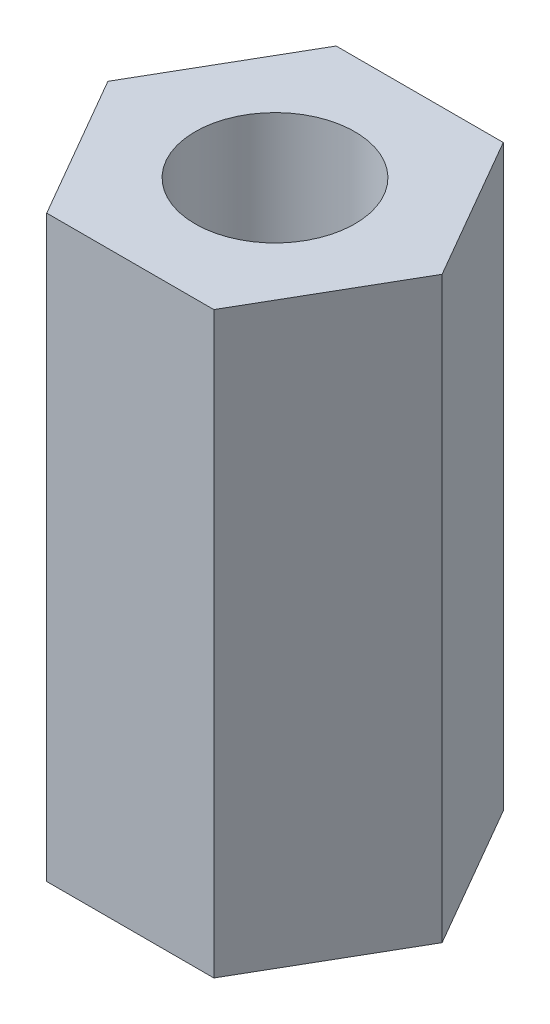
ISO-10303-21;
HEADER;
FILE_DESCRIPTION(('STEP AP214'),'2;1');
FILE_NAME('part.step','',(''),(''),'','','');
FILE_SCHEMA(('AUTOMOTIVE_DESIGN { 1 0 10303 214 1 1 1 1 }'));
ENDSEC;
DATA;
#1=APPLICATION_CONTEXT('core data for automotive mechanical design processes');
#2=APPLICATION_PROTOCOL_DEFINITION('international standard','automotive_design',2000,#1);
#3=PRODUCT_CONTEXT('',#1,'mechanical');
#4=PRODUCT('Part','Part','',(#3));
#5=PRODUCT_RELATED_PRODUCT_CATEGORY('part','',(#4));
#6=PRODUCT_DEFINITION_FORMATION('','',#4);
#7=PRODUCT_DEFINITION_CONTEXT('part definition',#1,'design');
#8=PRODUCT_DEFINITION('design','',#6,#7);
#9=PRODUCT_DEFINITION_SHAPE('','',#8);
#10=(LENGTH_UNIT() NAMED_UNIT(*) SI_UNIT(.MILLI.,.METRE.));
#11=(NAMED_UNIT(*) PLANE_ANGLE_UNIT() SI_UNIT($,.RADIAN.));
#12=(NAMED_UNIT(*) SI_UNIT($,.STERADIAN.) SOLID_ANGLE_UNIT());
#13=UNCERTAINTY_MEASURE_WITH_UNIT(LENGTH_MEASURE(1.E-05),#10,'distance_accuracy_value','');
#14=(GEOMETRIC_REPRESENTATION_CONTEXT(3) GLOBAL_UNCERTAINTY_ASSIGNED_CONTEXT((#13)) GLOBAL_UNIT_ASSIGNED_CONTEXT((#10,
#11,#12)) REPRESENTATION_CONTEXT('',''));
#15=CARTESIAN_POINT('',(0.,0.,0.));
#16=DIRECTION('',(0.,0.,1.));
#17=DIRECTION('',(1.,0.,0.));
#18=AXIS2_PLACEMENT_3D('',#15,#16,#17);
#19=CARTESIAN_POINT('',(3.66617420935412,12.7,0.));
#20=DIRECTION('',(0.,1.,0.));
#21=DIRECTION('',(0.,0.,1.));
#22=AXIS2_PLACEMENT_3D('',#19,#20,#21);
#23=PLANE('',#22);
#24=DIRECTION('',(0.5,0.,-0.866025403784439));
#25=VECTOR('',#24,1.);
#26=CARTESIAN_POINT('',(1.83308710467706,12.7,3.175));
#27=LINE('',#26,#25);
#28=CARTESIAN_POINT('',(1.83308710467706,12.7,3.175));
#29=VERTEX_POINT('',#28);
#30=CARTESIAN_POINT('',(3.66617420935412,12.7,0.));
#31=VERTEX_POINT('',#30);
#32=EDGE_CURVE('E129',#29,#31,#27,.T.);
#33=ORIENTED_EDGE('',*,*,#32,.T.);
#34=DIRECTION('',(-0.5,0.,-0.866025403784438));
#35=VECTOR('',#34,1.);
#36=CARTESIAN_POINT('',(3.66617420935412,12.7,0.));
#37=LINE('',#36,#35);
#38=CARTESIAN_POINT('',(1.83308710467706,12.7,-3.175));
#39=VERTEX_POINT('',#38);
#40=EDGE_CURVE('E87',#31,#39,#37,.T.);
#41=ORIENTED_EDGE('',*,*,#40,.T.);
#42=DIRECTION('',(-1.,0.,0.));
#43=VECTOR('',#42,1.);
#44=CARTESIAN_POINT('',(1.83308710467706,12.7,-3.175));
#45=LINE('',#44,#43);
#46=CARTESIAN_POINT('',(-1.83308710467706,12.7,-3.175));
#47=VERTEX_POINT('',#46);
#48=EDGE_CURVE('E100',#39,#47,#45,.T.);
#49=ORIENTED_EDGE('',*,*,#48,.T.);
#50=DIRECTION('',(-0.5,0.,0.866025403784439));
#51=VECTOR('',#50,1.);
#52=CARTESIAN_POINT('',(-1.83308710467706,12.7,-3.175));
#53=LINE('',#52,#51);
#54=CARTESIAN_POINT('',(-3.66617420935412,12.7,0.));
#55=VERTEX_POINT('',#54);
#56=EDGE_CURVE('E94',#47,#55,#53,.T.);
#57=ORIENTED_EDGE('',*,*,#56,.T.);
#58=DIRECTION('',(0.5,0.,0.866025403784438));
#59=VECTOR('',#58,1.);
#60=CARTESIAN_POINT('',(-3.66617420935412,12.7,0.));
#61=LINE('',#60,#59);
#62=CARTESIAN_POINT('',(-1.83308710467706,12.7,3.175));
#63=VERTEX_POINT('',#62);
#64=EDGE_CURVE('E98',#55,#63,#61,.T.);
#65=ORIENTED_EDGE('',*,*,#64,.T.);
#66=DIRECTION('',(1.,0.,0.));
#67=VECTOR('',#66,1.);
#68=CARTESIAN_POINT('',(-1.83308710467706,12.7,3.175));
#69=LINE('',#68,#67);
#70=EDGE_CURVE('E50',#63,#29,#69,.T.);
#71=ORIENTED_EDGE('',*,*,#70,.T.);
#72=EDGE_LOOP('',(#33,#41,#49,#57,#65,#71));
#73=FACE_BOUND('',#72,.T.);
#74=CARTESIAN_POINT('',(0.,12.7,0.));
#75=DIRECTION('',(0.,1.,0.));
#76=DIRECTION('',(0.,0.,1.));
#77=AXIS2_PLACEMENT_3D('',#74,#75,#76);
#78=CIRCLE('',#77,1.7526);
#79=CARTESIAN_POINT('',(0.,12.7,1.7526));
#80=VERTEX_POINT('',#79);
#81=EDGE_CURVE('E122',#80,#80,#78,.T.);
#82=ORIENTED_EDGE('',*,*,#81,.F.);
#83=EDGE_LOOP('',(#82));
#84=FACE_BOUND('',#83,.T.);
#85=ADVANCED_FACE('F33',(#73,#84),#23,.T.);
#86=CARTESIAN_POINT('',(3.66617420935412,0.,0.));
#87=DIRECTION('',(0.,1.,0.));
#88=DIRECTION('',(0.,0.,1.));
#89=AXIS2_PLACEMENT_3D('',#86,#87,#88);
#90=PLANE('',#89);
#91=DIRECTION('',(0.5,0.,-0.866025403784439));
#92=VECTOR('',#91,1.);
#93=CARTESIAN_POINT('',(1.83308710467706,0.,3.175));
#94=LINE('',#93,#92);
#95=CARTESIAN_POINT('',(1.83308710467706,0.,3.175));
#96=VERTEX_POINT('',#95);
#97=CARTESIAN_POINT('',(3.66617420935412,0.,0.));
#98=VERTEX_POINT('',#97);
#99=EDGE_CURVE('E118',#96,#98,#94,.T.);
#100=ORIENTED_EDGE('',*,*,#99,.F.);
#101=DIRECTION('',(1.,0.,0.));
#102=VECTOR('',#101,1.);
#103=CARTESIAN_POINT('',(-1.83308710467706,0.,3.175));
#104=LINE('',#103,#102);
#105=CARTESIAN_POINT('',(-1.83308710467706,0.,3.175));
#106=VERTEX_POINT('',#105);
#107=EDGE_CURVE('E79',#106,#96,#104,.T.);
#108=ORIENTED_EDGE('',*,*,#107,.F.);
#109=DIRECTION('',(0.5,0.,0.866025403784438));
#110=VECTOR('',#109,1.);
#111=CARTESIAN_POINT('',(-3.66617420935412,0.,0.));
#112=LINE('',#111,#110);
#113=CARTESIAN_POINT('',(-3.66617420935412,0.,0.));
#114=VERTEX_POINT('',#113);
#115=EDGE_CURVE('E73',#114,#106,#112,.T.);
#116=ORIENTED_EDGE('',*,*,#115,.F.);
#117=DIRECTION('',(-0.5,0.,0.866025403784439));
#118=VECTOR('',#117,1.);
#119=CARTESIAN_POINT('',(-1.83308710467706,0.,-3.175));
#120=LINE('',#119,#118);
#121=CARTESIAN_POINT('',(-1.83308710467706,0.,-3.175));
#122=VERTEX_POINT('',#121);
#123=EDGE_CURVE('E108',#122,#114,#120,.T.);
#124=ORIENTED_EDGE('',*,*,#123,.F.);
#125=DIRECTION('',(-1.,0.,0.));
#126=VECTOR('',#125,1.);
#127=CARTESIAN_POINT('',(1.83308710467706,0.,-3.175));
#128=LINE('',#127,#126);
#129=CARTESIAN_POINT('',(1.83308710467706,0.,-3.175));
#130=VERTEX_POINT('',#129);
#131=EDGE_CURVE('E124',#130,#122,#128,.T.);
#132=ORIENTED_EDGE('',*,*,#131,.F.);
#133=DIRECTION('',(-0.5,0.,-0.866025403784438));
#134=VECTOR('',#133,1.);
#135=CARTESIAN_POINT('',(3.66617420935412,0.,0.));
#136=LINE('',#135,#134);
#137=EDGE_CURVE('E121',#98,#130,#136,.T.);
#138=ORIENTED_EDGE('',*,*,#137,.F.);
#139=EDGE_LOOP('',(#100,#108,#116,#124,#132,#138));
#140=FACE_BOUND('',#139,.T.);
#141=CARTESIAN_POINT('',(0.,0.,0.));
#142=DIRECTION('',(0.,1.,0.));
#143=DIRECTION('',(0.,0.,1.));
#144=AXIS2_PLACEMENT_3D('',#141,#142,#143);
#145=CIRCLE('',#144,1.7526);
#146=CARTESIAN_POINT('',(0.,0.,1.7526));
#147=VERTEX_POINT('',#146);
#148=EDGE_CURVE('E222',#147,#147,#145,.T.);
#149=ORIENTED_EDGE('',*,*,#148,.T.);
#150=EDGE_LOOP('',(#149));
#151=FACE_BOUND('',#150,.T.);
#152=ADVANCED_FACE('F138',(#140,#151),#90,.F.);
#153=CARTESIAN_POINT('',(1.83308710467706,12.7,3.175));
#154=DIRECTION('',(-0.866025403784439,0.,-0.5));
#155=DIRECTION('',(-0.5,0.,0.866025403784439));
#156=AXIS2_PLACEMENT_3D('',#153,#154,#155);
#157=PLANE('',#156);
#158=ORIENTED_EDGE('',*,*,#99,.T.);
#159=DIRECTION('',(0.,-1.,0.));
#160=VECTOR('',#159,1.);
#161=CARTESIAN_POINT('',(3.66617420935412,12.7,0.));
#162=LINE('',#161,#160);
#163=EDGE_CURVE('E11',#31,#98,#162,.T.);
#164=ORIENTED_EDGE('',*,*,#163,.F.);
#165=ORIENTED_EDGE('',*,*,#32,.F.);
#166=DIRECTION('',(0.,-1.,0.));
#167=VECTOR('',#166,1.);
#168=CARTESIAN_POINT('',(1.83308710467706,12.7,3.175));
#169=LINE('',#168,#167);
#170=EDGE_CURVE('E114',#29,#96,#169,.T.);
#171=ORIENTED_EDGE('',*,*,#170,.T.);
#172=EDGE_LOOP('',(#158,#164,#165,#171));
#173=FACE_BOUND('',#172,.T.);
#174=ADVANCED_FACE('F35',(#173),#157,.F.);
#175=CARTESIAN_POINT('',(3.66617420935412,12.7,0.));
#176=DIRECTION('',(-0.866025403784438,0.,0.5));
#177=DIRECTION('',(0.5,0.,0.866025403784439));
#178=AXIS2_PLACEMENT_3D('',#175,#176,#177);
#179=PLANE('',#178);
#180=ORIENTED_EDGE('',*,*,#137,.T.);
#181=DIRECTION('',(0.,-1.,0.));
#182=VECTOR('',#181,1.);
#183=CARTESIAN_POINT('',(1.83308710467706,12.7,-3.175));
#184=LINE('',#183,#182);
#185=EDGE_CURVE('E42',#39,#130,#184,.T.);
#186=ORIENTED_EDGE('',*,*,#185,.F.);
#187=ORIENTED_EDGE('',*,*,#40,.F.);
#188=ORIENTED_EDGE('',*,*,#163,.T.);
#189=EDGE_LOOP('',(#180,#186,#187,#188));
#190=FACE_BOUND('',#189,.T.);
#191=ADVANCED_FACE('F163',(#190),#179,.F.);
#192=CARTESIAN_POINT('',(1.83308710467706,12.7,-3.175));
#193=DIRECTION('',(0.,0.,1.));
#194=DIRECTION('',(1.,0.,0.));
#195=AXIS2_PLACEMENT_3D('',#192,#193,#194);
#196=PLANE('',#195);
#197=ORIENTED_EDGE('',*,*,#131,.T.);
#198=DIRECTION('',(0.,-1.,0.));
#199=VECTOR('',#198,1.);
#200=CARTESIAN_POINT('',(-1.83308710467706,12.7,-3.175));
#201=LINE('',#200,#199);
#202=EDGE_CURVE('E109',#47,#122,#201,.T.);
#203=ORIENTED_EDGE('',*,*,#202,.F.);
#204=ORIENTED_EDGE('',*,*,#48,.F.);
#205=ORIENTED_EDGE('',*,*,#185,.T.);
#206=EDGE_LOOP('',(#197,#203,#204,#205));
#207=FACE_BOUND('',#206,.T.);
#208=ADVANCED_FACE('F135',(#207),#196,.F.);
#209=CARTESIAN_POINT('',(-1.83308710467706,12.7,-3.175));
#210=DIRECTION('',(0.866025403784439,0.,0.5));
#211=DIRECTION('',(0.5,0.,-0.866025403784439));
#212=AXIS2_PLACEMENT_3D('',#209,#210,#211);
#213=PLANE('',#212);
#214=ORIENTED_EDGE('',*,*,#123,.T.);
#215=DIRECTION('',(0.,-1.,0.));
#216=VECTOR('',#215,1.);
#217=CARTESIAN_POINT('',(-3.66617420935412,12.7,0.));
#218=LINE('',#217,#216);
#219=EDGE_CURVE('E105',#55,#114,#218,.T.);
#220=ORIENTED_EDGE('',*,*,#219,.F.);
#221=ORIENTED_EDGE('',*,*,#56,.F.);
#222=ORIENTED_EDGE('',*,*,#202,.T.);
#223=EDGE_LOOP('',(#214,#220,#221,#222));
#224=FACE_BOUND('',#223,.T.);
#225=ADVANCED_FACE('F106',(#224),#213,.F.);
#226=CARTESIAN_POINT('',(-3.66617420935412,12.7,0.));
#227=DIRECTION('',(0.866025403784438,0.,-0.5));
#228=DIRECTION('',(-0.5,0.,-0.866025403784438));
#229=AXIS2_PLACEMENT_3D('',#226,#227,#228);
#230=PLANE('',#229);
#231=ORIENTED_EDGE('',*,*,#115,.T.);
#232=DIRECTION('',(0.,-1.,0.));
#233=VECTOR('',#232,1.);
#234=CARTESIAN_POINT('',(-1.83308710467706,12.7,3.175));
#235=LINE('',#234,#233);
#236=EDGE_CURVE('E110',#63,#106,#235,.T.);
#237=ORIENTED_EDGE('',*,*,#236,.F.);
#238=ORIENTED_EDGE('',*,*,#64,.F.);
#239=ORIENTED_EDGE('',*,*,#219,.T.);
#240=EDGE_LOOP('',(#231,#237,#238,#239));
#241=FACE_BOUND('',#240,.T.);
#242=ADVANCED_FACE('F112',(#241),#230,.F.);
#243=CARTESIAN_POINT('',(-1.83308710467706,12.7,3.175));
#244=DIRECTION('',(0.,0.,-1.));
#245=DIRECTION('',(-1.,0.,0.));
#246=AXIS2_PLACEMENT_3D('',#243,#244,#245);
#247=PLANE('',#246);
#248=ORIENTED_EDGE('',*,*,#107,.T.);
#249=ORIENTED_EDGE('',*,*,#170,.F.);
#250=ORIENTED_EDGE('',*,*,#70,.F.);
#251=ORIENTED_EDGE('',*,*,#236,.T.);
#252=EDGE_LOOP('',(#248,#249,#250,#251));
#253=FACE_BOUND('',#252,.T.);
#254=ADVANCED_FACE('F143',(#253),#247,.F.);
#255=CARTESIAN_POINT('',(0.,12.7,0.));
#256=DIRECTION('',(0.,-1.,0.));
#257=DIRECTION('',(0.,0.,-1.));
#258=AXIS2_PLACEMENT_3D('',#255,#256,#257);
#259=CYLINDRICAL_SURFACE('',#258,1.7526);
#260=ORIENTED_EDGE('',*,*,#81,.T.);
#261=EDGE_LOOP('',(#260));
#262=FACE_BOUND('',#261,.T.);
#263=ORIENTED_EDGE('',*,*,#148,.F.);
#264=EDGE_LOOP('',(#263));
#265=FACE_BOUND('',#264,.T.);
#266=ADVANCED_FACE('F145',(#262,#265),#259,.F.);
#267=CLOSED_SHELL('',(#85,#152,#174,#191,#208,#225,#242,#254,#266));
#268=MANIFOLD_SOLID_BREP('B2',#267);
#269=ADVANCED_BREP_SHAPE_REPRESENTATION('',(#18,#268),#14);
#270=SHAPE_DEFINITION_REPRESENTATION(#9,#269);
ENDSEC;
END-ISO-10303-21;
